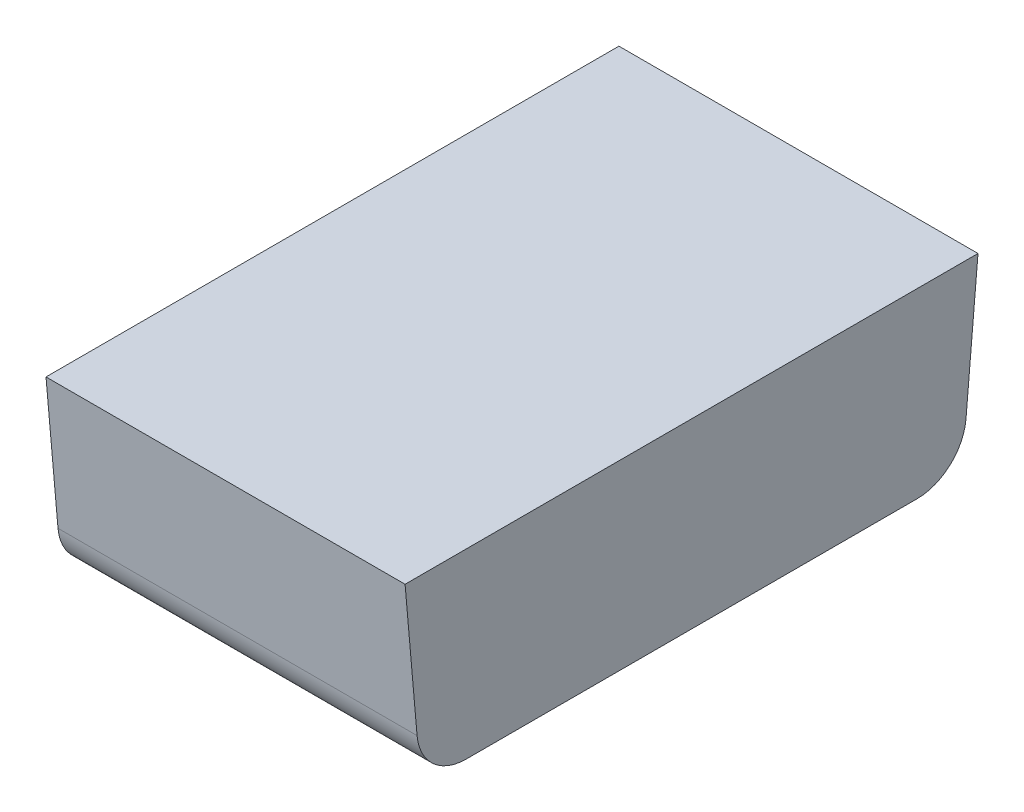
ISO-10303-21;
HEADER;
FILE_DESCRIPTION(('STEP AP214'),'2;1');
FILE_NAME('part.step','',(''),(''),'','','');
FILE_SCHEMA(('AUTOMOTIVE_DESIGN { 1 0 10303 214 1 1 1 1 }'));
ENDSEC;
DATA;
#1=APPLICATION_CONTEXT('core data for automotive mechanical design processes');
#2=APPLICATION_PROTOCOL_DEFINITION('international standard','automotive_design',2000,#1);
#3=PRODUCT_CONTEXT('',#1,'mechanical');
#4=PRODUCT('Part','Part','',(#3));
#5=PRODUCT_RELATED_PRODUCT_CATEGORY('part','',(#4));
#6=PRODUCT_DEFINITION_FORMATION('','',#4);
#7=PRODUCT_DEFINITION_CONTEXT('part definition',#1,'design');
#8=PRODUCT_DEFINITION('design','',#6,#7);
#9=PRODUCT_DEFINITION_SHAPE('','',#8);
#10=(LENGTH_UNIT() NAMED_UNIT(*) SI_UNIT(.MILLI.,.METRE.));
#11=(NAMED_UNIT(*) PLANE_ANGLE_UNIT() SI_UNIT($,.RADIAN.));
#12=(NAMED_UNIT(*) SI_UNIT($,.STERADIAN.) SOLID_ANGLE_UNIT());
#13=UNCERTAINTY_MEASURE_WITH_UNIT(LENGTH_MEASURE(1.E-05),#10,'distance_accuracy_value','');
#14=(GEOMETRIC_REPRESENTATION_CONTEXT(3) GLOBAL_UNCERTAINTY_ASSIGNED_CONTEXT((#13)) GLOBAL_UNIT_ASSIGNED_CONTEXT((#10,
#11,#12)) REPRESENTATION_CONTEXT('',''));
#15=CARTESIAN_POINT('',(0.,0.,0.));
#16=DIRECTION('',(0.,0.,1.));
#17=DIRECTION('',(1.,0.,0.));
#18=AXIS2_PLACEMENT_3D('',#15,#16,#17);
#19=CARTESIAN_POINT('',(1.16,-1.3,-31.0416331174));
#20=DIRECTION('',(-1.,0.,0.));
#21=DIRECTION('',(0.,0.,1.));
#22=AXIS2_PLACEMENT_3D('',#19,#20,#21);
#23=CYLINDRICAL_SURFACE('',#22,0.0999999999999998);
#24=CARTESIAN_POINT('',(1.16,-1.3,-31.0416331174));
#25=DIRECTION('',(-1.,0.,0.));
#26=DIRECTION('',(0.,0.,1.));
#27=AXIS2_PLACEMENT_3D('',#24,#25,#26);
#28=CIRCLE('',#27,0.0999999999999998);
#29=CARTESIAN_POINT('',(1.16,-1.30871557427365,-30.9420136475899));
#30=VERTEX_POINT('',#29);
#31=CARTESIAN_POINT('',(1.16,-1.4,-31.0416331174));
#32=VERTEX_POINT('',#31);
#33=EDGE_CURVE('E21',#30,#32,#28,.F.);
#34=ORIENTED_EDGE('',*,*,#33,.F.);
#35=DIRECTION('',(1.,0.,0.));
#36=VECTOR('',#35,1.);
#37=CARTESIAN_POINT('',(0.795,-1.308715574275,-30.94201364759));
#38=LINE('',#37,#36);
#39=CARTESIAN_POINT('',(0.43,-1.30871557427458,-30.9420136475934));
#40=VERTEX_POINT('',#39);
#41=EDGE_CURVE('E61',#40,#30,#38,.T.);
#42=ORIENTED_EDGE('',*,*,#41,.F.);
#43=CARTESIAN_POINT('',(0.43,-1.3,-31.0416331174));
#44=DIRECTION('',(-1.,0.,0.));
#45=DIRECTION('',(0.,0.,1.));
#46=AXIS2_PLACEMENT_3D('',#43,#44,#45);
#47=CIRCLE('',#46,0.0999999999999998);
#48=CARTESIAN_POINT('',(0.43,-1.4,-31.0416331174));
#49=VERTEX_POINT('',#48);
#50=EDGE_CURVE('E84',#49,#40,#47,.T.);
#51=ORIENTED_EDGE('',*,*,#50,.F.);
#52=DIRECTION('',(-1.,0.,0.));
#53=VECTOR('',#52,1.);
#54=CARTESIAN_POINT('',(0.795,-1.4,-31.0416331174));
#55=LINE('',#54,#53);
#56=EDGE_CURVE('E74',#32,#49,#55,.T.);
#57=ORIENTED_EDGE('',*,*,#56,.F.);
#58=EDGE_LOOP('',(#34,#42,#51,#57));
#59=FACE_BOUND('',#58,.T.);
#60=ADVANCED_FACE('F17',(#59),#23,.T.);
#61=CARTESIAN_POINT('',(0.43,-1.3,-31.9583668826));
#62=DIRECTION('',(1.,0.,0.));
#63=DIRECTION('',(0.,0.,-1.));
#64=AXIS2_PLACEMENT_3D('',#61,#62,#63);
#65=CYLINDRICAL_SURFACE('',#64,0.0999999999999998);
#66=CARTESIAN_POINT('',(0.43,-1.3,-31.9583668826));
#67=DIRECTION('',(1.,0.,0.));
#68=DIRECTION('',(0.,0.,-1.));
#69=AXIS2_PLACEMENT_3D('',#66,#67,#68);
#70=CIRCLE('',#69,0.0999999999999998);
#71=CARTESIAN_POINT('',(0.43,-1.30871557427469,-32.0579863524061));
#72=VERTEX_POINT('',#71);
#73=CARTESIAN_POINT('',(0.43,-1.4,-31.9583668826));
#74=VERTEX_POINT('',#73);
#75=EDGE_CURVE('E97',#72,#74,#70,.F.);
#76=ORIENTED_EDGE('',*,*,#75,.F.);
#77=DIRECTION('',(-1.,0.,0.));
#78=VECTOR('',#77,1.);
#79=CARTESIAN_POINT('',(0.795,-1.308715574275,-32.05798635241));
#80=LINE('',#79,#78);
#81=CARTESIAN_POINT('',(1.16,-1.30871557427458,-32.0579863524066));
#82=VERTEX_POINT('',#81);
#83=EDGE_CURVE('E79',#82,#72,#80,.T.);
#84=ORIENTED_EDGE('',*,*,#83,.F.);
#85=CARTESIAN_POINT('',(1.16,-1.3,-31.9583668826));
#86=DIRECTION('',(1.,0.,0.));
#87=DIRECTION('',(0.,0.,-1.));
#88=AXIS2_PLACEMENT_3D('',#85,#86,#87);
#89=CIRCLE('',#88,0.0999999999999998);
#90=CARTESIAN_POINT('',(1.16,-1.4,-31.9583668826));
#91=VERTEX_POINT('',#90);
#92=EDGE_CURVE('E105',#91,#82,#89,.T.);
#93=ORIENTED_EDGE('',*,*,#92,.F.);
#94=DIRECTION('',(1.,0.,0.));
#95=VECTOR('',#94,1.);
#96=CARTESIAN_POINT('',(0.795,-1.4,-31.9583668826));
#97=LINE('',#96,#95);
#98=EDGE_CURVE('E111',#74,#91,#97,.T.);
#99=ORIENTED_EDGE('',*,*,#98,.F.);
#100=EDGE_LOOP('',(#76,#84,#93,#99));
#101=FACE_BOUND('',#100,.T.);
#102=ADVANCED_FACE('F130',(#101),#65,.T.);
#103=CARTESIAN_POINT('',(0.43,-1.4,-31.9583668826));
#104=DIRECTION('',(0.,-1.,0.));
#105=DIRECTION('',(1.,0.,0.));
#106=AXIS2_PLACEMENT_3D('',#103,#104,#105);
#107=PLANE('',#106);
#108=ORIENTED_EDGE('',*,*,#98,.T.);
#109=DIRECTION('',(0.,0.,-1.));
#110=VECTOR('',#109,1.);
#111=CARTESIAN_POINT('',(1.16,-1.4,-31.5));
#112=LINE('',#111,#110);
#113=EDGE_CURVE('E78',#32,#91,#112,.T.);
#114=ORIENTED_EDGE('',*,*,#113,.F.);
#115=ORIENTED_EDGE('',*,*,#56,.T.);
#116=DIRECTION('',(0.,0.,1.));
#117=VECTOR('',#116,1.);
#118=CARTESIAN_POINT('',(0.43,-1.4,-31.5));
#119=LINE('',#118,#117);
#120=EDGE_CURVE('E100',#74,#49,#119,.T.);
#121=ORIENTED_EDGE('',*,*,#120,.F.);
#122=EDGE_LOOP('',(#108,#114,#115,#121));
#123=FACE_BOUND('',#122,.T.);
#124=ADVANCED_FACE('F133',(#123),#107,.T.);
#125=CARTESIAN_POINT('',(0.43,-1.03,-32.0823708055));
#126=DIRECTION('',(0.,-0.0871557427222083,-0.996194698093972));
#127=DIRECTION('',(1.,0.,0.));
#128=AXIS2_PLACEMENT_3D('',#125,#126,#127);
#129=PLANE('',#128);
#130=DIRECTION('',(1.,0.,0.));
#131=VECTOR('',#130,1.);
#132=CARTESIAN_POINT('',(0.795,-1.03,-32.0823708055));
#133=LINE('',#132,#131);
#134=CARTESIAN_POINT('',(0.43,-1.03,-32.0823708055));
#135=VERTEX_POINT('',#134);
#136=CARTESIAN_POINT('',(1.16,-1.03,-32.0823708055));
#137=VERTEX_POINT('',#136);
#138=EDGE_CURVE('E94',#135,#137,#133,.T.);
#139=ORIENTED_EDGE('',*,*,#138,.T.);
#140=DIRECTION('',(0.,0.996194698091811,-0.0871557427469079));
#141=VECTOR('',#140,1.);
#142=CARTESIAN_POINT('',(1.16,-1.3087155742748,-32.0579863524031));
#143=LINE('',#142,#141);
#144=EDGE_CURVE('E70',#82,#137,#143,.T.);
#145=ORIENTED_EDGE('',*,*,#144,.F.);
#146=ORIENTED_EDGE('',*,*,#83,.T.);
#147=DIRECTION('',(0.,-0.996194698091546,0.0871557427499353));
#148=VECTOR('',#147,1.);
#149=CARTESIAN_POINT('',(0.43,-1.03,-32.0823708055));
#150=LINE('',#149,#148);
#151=EDGE_CURVE('E101',#135,#72,#150,.T.);
#152=ORIENTED_EDGE('',*,*,#151,.F.);
#153=EDGE_LOOP('',(#139,#145,#146,#152));
#154=FACE_BOUND('',#153,.T.);
#155=ADVANCED_FACE('F128',(#154),#129,.T.);
#156=CARTESIAN_POINT('',(1.16,-1.03,-32.0823708055));
#157=DIRECTION('',(1.,0.,0.));
#158=DIRECTION('',(0.,0.,1.));
#159=AXIS2_PLACEMENT_3D('',#156,#157,#158);
#160=PLANE('',#159);
#161=DIRECTION('',(0.,0.,1.));
#162=VECTOR('',#161,1.);
#163=CARTESIAN_POINT('',(1.16,-1.03,-31.5));
#164=LINE('',#163,#162);
#165=CARTESIAN_POINT('',(1.16,-1.03,-30.9176291945));
#166=VERTEX_POINT('',#165);
#167=EDGE_CURVE('E83',#137,#166,#164,.T.);
#168=ORIENTED_EDGE('',*,*,#167,.T.);
#169=DIRECTION('',(0.,0.996194698093972,0.0871557427222083));
#170=VECTOR('',#169,1.);
#171=CARTESIAN_POINT('',(1.16,-1.1693577871375,-30.929821421045));
#172=LINE('',#171,#170);
#173=EDGE_CURVE('E66',#30,#166,#172,.T.);
#174=ORIENTED_EDGE('',*,*,#173,.F.);
#175=ORIENTED_EDGE('',*,*,#33,.T.);
#176=ORIENTED_EDGE('',*,*,#113,.T.);
#177=ORIENTED_EDGE('',*,*,#92,.T.);
#178=ORIENTED_EDGE('',*,*,#144,.T.);
#179=EDGE_LOOP('',(#168,#174,#175,#176,#177,#178));
#180=FACE_BOUND('',#179,.T.);
#181=ADVANCED_FACE('F81',(#180),#160,.T.);
#182=CARTESIAN_POINT('',(1.16,-1.03,-30.9176291945));
#183=DIRECTION('',(0.,-0.0871557427222083,0.996194698093972));
#184=DIRECTION('',(-1.,0.,0.));
#185=AXIS2_PLACEMENT_3D('',#182,#183,#184);
#186=PLANE('',#185);
#187=DIRECTION('',(-1.,0.,0.));
#188=VECTOR('',#187,1.);
#189=CARTESIAN_POINT('',(0.795,-1.03,-30.9176291945));
#190=LINE('',#189,#188);
#191=CARTESIAN_POINT('',(0.43,-1.03,-30.9176291945));
#192=VERTEX_POINT('',#191);
#193=EDGE_CURVE('E27',#166,#192,#190,.T.);
#194=ORIENTED_EDGE('',*,*,#193,.T.);
#195=DIRECTION('',(0.,0.996194698091809,0.0871557427469325));
#196=VECTOR('',#195,1.);
#197=CARTESIAN_POINT('',(0.43,-1.3087155742748,-30.942013647597));
#198=LINE('',#197,#196);
#199=EDGE_CURVE('E35',#40,#192,#198,.T.);
#200=ORIENTED_EDGE('',*,*,#199,.F.);
#201=ORIENTED_EDGE('',*,*,#41,.T.);
#202=ORIENTED_EDGE('',*,*,#173,.T.);
#203=EDGE_LOOP('',(#194,#200,#201,#202));
#204=FACE_BOUND('',#203,.T.);
#205=ADVANCED_FACE('F64',(#204),#186,.T.);
#206=CARTESIAN_POINT('',(0.43,-1.03,-30.9176291945));
#207=DIRECTION('',(-1.,0.,0.));
#208=DIRECTION('',(0.,0.,-1.));
#209=AXIS2_PLACEMENT_3D('',#206,#207,#208);
#210=PLANE('',#209);
#211=ORIENTED_EDGE('',*,*,#75,.T.);
#212=ORIENTED_EDGE('',*,*,#120,.T.);
#213=ORIENTED_EDGE('',*,*,#50,.T.);
#214=ORIENTED_EDGE('',*,*,#199,.T.);
#215=DIRECTION('',(0.,0.,-1.));
#216=VECTOR('',#215,1.);
#217=CARTESIAN_POINT('',(0.43,-1.03,-31.5));
#218=LINE('',#217,#216);
#219=EDGE_CURVE('E11',#192,#135,#218,.T.);
#220=ORIENTED_EDGE('',*,*,#219,.T.);
#221=ORIENTED_EDGE('',*,*,#151,.T.);
#222=EDGE_LOOP('',(#211,#212,#213,#214,#220,#221));
#223=FACE_BOUND('',#222,.T.);
#224=ADVANCED_FACE('F120',(#223),#210,.T.);
#225=CARTESIAN_POINT('',(0.43,-1.03,-32.0823708055));
#226=DIRECTION('',(0.,-1.,0.));
#227=DIRECTION('',(1.,0.,0.));
#228=AXIS2_PLACEMENT_3D('',#225,#226,#227);
#229=PLANE('',#228);
#230=ORIENTED_EDGE('',*,*,#193,.F.);
#231=ORIENTED_EDGE('',*,*,#167,.F.);
#232=ORIENTED_EDGE('',*,*,#138,.F.);
#233=ORIENTED_EDGE('',*,*,#219,.F.);
#234=EDGE_LOOP('',(#230,#231,#232,#233));
#235=FACE_BOUND('',#234,.T.);
#236=ADVANCED_FACE('F19',(#235),#229,.F.);
#237=CLOSED_SHELL('',(#60,#102,#124,#155,#181,#205,#224,#236));
#238=MANIFOLD_SOLID_BREP('B1',#237);
#239=ADVANCED_BREP_SHAPE_REPRESENTATION('',(#18,#238),#14);
#240=SHAPE_DEFINITION_REPRESENTATION(#9,#239);
ENDSEC;
END-ISO-10303-21;
